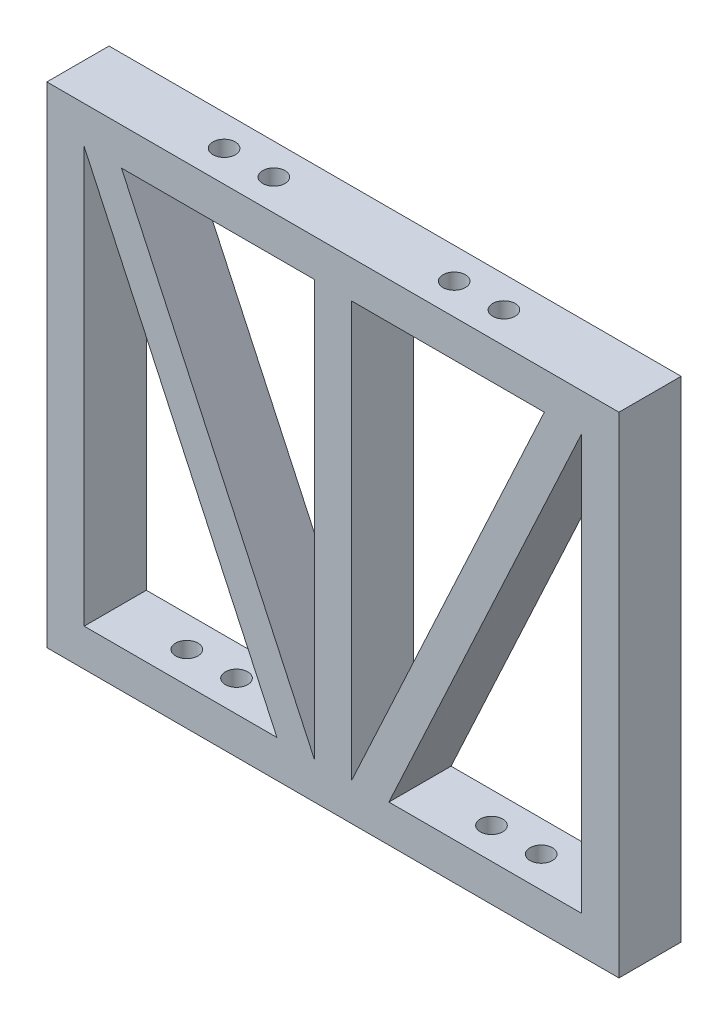
ISO-10303-21;
HEADER;
FILE_DESCRIPTION(('STEP AP214'),'2;1');
FILE_NAME('part.step','',(''),(''),'','','');
FILE_SCHEMA(('AUTOMOTIVE_DESIGN { 1 0 10303 214 1 1 1 1 }'));
ENDSEC;
DATA;
#1=APPLICATION_CONTEXT('core data for automotive mechanical design processes');
#2=APPLICATION_PROTOCOL_DEFINITION('international standard','automotive_design',2000,#1);
#3=PRODUCT_CONTEXT('',#1,'mechanical');
#4=PRODUCT('Part','Part','',(#3));
#5=PRODUCT_RELATED_PRODUCT_CATEGORY('part','',(#4));
#6=PRODUCT_DEFINITION_FORMATION('','',#4);
#7=PRODUCT_DEFINITION_CONTEXT('part definition',#1,'design');
#8=PRODUCT_DEFINITION('design','',#6,#7);
#9=PRODUCT_DEFINITION_SHAPE('','',#8);
#10=(LENGTH_UNIT() NAMED_UNIT(*) SI_UNIT(.MILLI.,.METRE.));
#11=(NAMED_UNIT(*) PLANE_ANGLE_UNIT() SI_UNIT($,.RADIAN.));
#12=(NAMED_UNIT(*) SI_UNIT($,.STERADIAN.) SOLID_ANGLE_UNIT());
#13=UNCERTAINTY_MEASURE_WITH_UNIT(LENGTH_MEASURE(1.E-05),#10,'distance_accuracy_value','');
#14=(GEOMETRIC_REPRESENTATION_CONTEXT(3) GLOBAL_UNCERTAINTY_ASSIGNED_CONTEXT((#13)) GLOBAL_UNIT_ASSIGNED_CONTEXT((#10,
#11,#12)) REPRESENTATION_CONTEXT('',''));
#15=CARTESIAN_POINT('',(0.,0.,0.));
#16=DIRECTION('',(0.,0.,1.));
#17=DIRECTION('',(1.,0.,0.));
#18=AXIS2_PLACEMENT_3D('',#15,#16,#17);
#19=CARTESIAN_POINT('',(0.,0.,6.35));
#20=DIRECTION('',(0.,0.,-1.));
#21=DIRECTION('',(-1.,0.,0.));
#22=AXIS2_PLACEMENT_3D('',#19,#20,#21);
#23=PLANE('',#22);
#24=DIRECTION('',(0.,1.,0.));
#25=VECTOR('',#24,1.);
#26=CARTESIAN_POINT('',(-1.905,3.81,6.35));
#27=LINE('',#26,#25);
#28=CARTESIAN_POINT('',(-1.905,3.81,6.35));
#29=VERTEX_POINT('',#28);
#30=CARTESIAN_POINT('',(-1.905,46.228,6.35));
#31=VERTEX_POINT('',#30);
#32=EDGE_CURVE('E178',#29,#31,#27,.T.);
#33=ORIENTED_EDGE('',*,*,#32,.F.);
#34=DIRECTION('',(0.42095171359802,-0.907083047366056,0.));
#35=VECTOR('',#34,1.);
#36=CARTESIAN_POINT('',(-21.59,46.228,6.35));
#37=LINE('',#36,#35);
#38=CARTESIAN_POINT('',(-21.59,46.228,6.35));
#39=VERTEX_POINT('',#38);
#40=EDGE_CURVE('E184',#39,#29,#37,.T.);
#41=ORIENTED_EDGE('',*,*,#40,.F.);
#42=DIRECTION('',(-1.,0.,0.));
#43=VECTOR('',#42,1.);
#44=CARTESIAN_POINT('',(-1.905,46.228,6.35));
#45=LINE('',#44,#43);
#46=EDGE_CURVE('E180',#31,#39,#45,.T.);
#47=ORIENTED_EDGE('',*,*,#46,.F.);
#48=EDGE_LOOP('',(#33,#41,#47));
#49=FACE_BOUND('',#48,.T.);
#50=DIRECTION('',(-0.42095171359802,0.907083047366056,0.));
#51=VECTOR('',#50,1.);
#52=CARTESIAN_POINT('',(-5.715,3.81,6.35));
#53=LINE('',#52,#51);
#54=CARTESIAN_POINT('',(-5.715,3.81,6.35));
#55=VERTEX_POINT('',#54);
#56=CARTESIAN_POINT('',(-25.4,46.228,6.35));
#57=VERTEX_POINT('',#56);
#58=EDGE_CURVE('E226',#55,#57,#53,.T.);
#59=ORIENTED_EDGE('',*,*,#58,.F.);
#60=DIRECTION('',(1.,0.,0.));
#61=VECTOR('',#60,1.);
#62=CARTESIAN_POINT('',(-25.4,3.81,6.35));
#63=LINE('',#62,#61);
#64=CARTESIAN_POINT('',(-25.4,3.81,6.35));
#65=VERTEX_POINT('',#64);
#66=EDGE_CURVE('E232',#65,#55,#63,.T.);
#67=ORIENTED_EDGE('',*,*,#66,.F.);
#68=DIRECTION('',(0.,-1.,0.));
#69=VECTOR('',#68,1.);
#70=CARTESIAN_POINT('',(-25.4,46.228,6.35));
#71=LINE('',#70,#69);
#72=EDGE_CURVE('E228',#57,#65,#71,.T.);
#73=ORIENTED_EDGE('',*,*,#72,.F.);
#74=EDGE_LOOP('',(#59,#67,#73));
#75=FACE_BOUND('',#74,.T.);
#76=DIRECTION('',(0.,-1.,0.));
#77=VECTOR('',#76,1.);
#78=CARTESIAN_POINT('',(-29.21,0.,6.35));
#79=LINE('',#78,#77);
#80=CARTESIAN_POINT('',(-29.21,50.038,6.35));
#81=VERTEX_POINT('',#80);
#82=CARTESIAN_POINT('',(-29.21,0.,6.35));
#83=VERTEX_POINT('',#82);
#84=EDGE_CURVE('E250',#81,#83,#79,.T.);
#85=ORIENTED_EDGE('',*,*,#84,.T.);
#86=DIRECTION('',(1.,0.,0.));
#87=VECTOR('',#86,1.);
#88=CARTESIAN_POINT('',(-29.21,0.,6.35));
#89=LINE('',#88,#87);
#90=CARTESIAN_POINT('',(29.21,0.,6.35));
#91=VERTEX_POINT('',#90);
#92=EDGE_CURVE('E253',#83,#91,#89,.T.);
#93=ORIENTED_EDGE('',*,*,#92,.T.);
#94=DIRECTION('',(0.,1.,0.));
#95=VECTOR('',#94,1.);
#96=CARTESIAN_POINT('',(29.21,0.,6.35));
#97=LINE('',#96,#95);
#98=CARTESIAN_POINT('',(29.21,50.038,6.35));
#99=VERTEX_POINT('',#98);
#100=EDGE_CURVE('E256',#91,#99,#97,.T.);
#101=ORIENTED_EDGE('',*,*,#100,.T.);
#102=DIRECTION('',(-1.,0.,0.));
#103=VECTOR('',#102,1.);
#104=CARTESIAN_POINT('',(-29.21,50.038,6.35));
#105=LINE('',#104,#103);
#106=EDGE_CURVE('E258',#99,#81,#105,.T.);
#107=ORIENTED_EDGE('',*,*,#106,.T.);
#108=EDGE_LOOP('',(#85,#93,#101,#107));
#109=FACE_BOUND('',#108,.T.);
#110=DIRECTION('',(-1.,0.,0.));
#111=VECTOR('',#110,1.);
#112=CARTESIAN_POINT('',(21.59,46.228,6.35));
#113=LINE('',#112,#111);
#114=CARTESIAN_POINT('',(21.59,46.228,6.35));
#115=VERTEX_POINT('',#114);
#116=CARTESIAN_POINT('',(1.905,46.228,6.35));
#117=VERTEX_POINT('',#116);
#118=EDGE_CURVE('E202',#115,#117,#113,.T.);
#119=ORIENTED_EDGE('',*,*,#118,.F.);
#120=DIRECTION('',(0.42095171359802,0.907083047366056,0.));
#121=VECTOR('',#120,1.);
#122=CARTESIAN_POINT('',(1.90500000000001,3.81,6.35));
#123=LINE('',#122,#121);
#124=CARTESIAN_POINT('',(1.90500000000001,3.81,6.35));
#125=VERTEX_POINT('',#124);
#126=EDGE_CURVE('E208',#125,#115,#123,.T.);
#127=ORIENTED_EDGE('',*,*,#126,.F.);
#128=DIRECTION('',(0.,-1.,0.));
#129=VECTOR('',#128,1.);
#130=CARTESIAN_POINT('',(1.905,46.228,6.35));
#131=LINE('',#130,#129);
#132=EDGE_CURVE('E204',#117,#125,#131,.T.);
#133=ORIENTED_EDGE('',*,*,#132,.F.);
#134=EDGE_LOOP('',(#119,#127,#133));
#135=FACE_BOUND('',#134,.T.);
#136=DIRECTION('',(1.,0.,0.));
#137=VECTOR('',#136,1.);
#138=CARTESIAN_POINT('',(25.4,3.81,6.35));
#139=LINE('',#138,#137);
#140=CARTESIAN_POINT('',(5.71500000000001,3.81,6.35));
#141=VERTEX_POINT('',#140);
#142=CARTESIAN_POINT('',(25.4,3.81,6.35));
#143=VERTEX_POINT('',#142);
#144=EDGE_CURVE('E149',#141,#143,#139,.T.);
#145=ORIENTED_EDGE('',*,*,#144,.F.);
#146=DIRECTION('',(-0.42095171359802,-0.907083047366056,0.));
#147=VECTOR('',#146,1.);
#148=CARTESIAN_POINT('',(5.71500000000001,3.81,6.35));
#149=LINE('',#148,#147);
#150=CARTESIAN_POINT('',(25.4,46.228,6.35));
#151=VERTEX_POINT('',#150);
#152=EDGE_CURVE('E166',#151,#141,#149,.T.);
#153=ORIENTED_EDGE('',*,*,#152,.F.);
#154=DIRECTION('',(0.,1.,0.));
#155=VECTOR('',#154,1.);
#156=CARTESIAN_POINT('',(25.4,46.228,6.35));
#157=LINE('',#156,#155);
#158=EDGE_CURVE('E157',#143,#151,#157,.T.);
#159=ORIENTED_EDGE('',*,*,#158,.F.);
#160=EDGE_LOOP('',(#145,#153,#159));
#161=FACE_BOUND('',#160,.T.);
#162=ADVANCED_FACE('F36',(#49,#75,#109,#135,#161),#23,.F.);
#163=CARTESIAN_POINT('',(0.,0.,0.));
#164=DIRECTION('',(0.,0.,-1.));
#165=DIRECTION('',(-1.,0.,0.));
#166=AXIS2_PLACEMENT_3D('',#163,#164,#165);
#167=PLANE('',#166);
#168=DIRECTION('',(0.,-1.,0.));
#169=VECTOR('',#168,1.);
#170=CARTESIAN_POINT('',(-29.21,0.,0.));
#171=LINE('',#170,#169);
#172=CARTESIAN_POINT('',(-29.21,50.038,0.));
#173=VERTEX_POINT('',#172);
#174=CARTESIAN_POINT('',(-29.21,0.,0.));
#175=VERTEX_POINT('',#174);
#176=EDGE_CURVE('E249',#173,#175,#171,.T.);
#177=ORIENTED_EDGE('',*,*,#176,.F.);
#178=DIRECTION('',(-1.,0.,0.));
#179=VECTOR('',#178,1.);
#180=CARTESIAN_POINT('',(-29.21,50.038,0.));
#181=LINE('',#180,#179);
#182=CARTESIAN_POINT('',(29.21,50.038,0.));
#183=VERTEX_POINT('',#182);
#184=EDGE_CURVE('E254',#183,#173,#181,.T.);
#185=ORIENTED_EDGE('',*,*,#184,.F.);
#186=DIRECTION('',(0.,1.,0.));
#187=VECTOR('',#186,1.);
#188=CARTESIAN_POINT('',(29.21,0.,0.));
#189=LINE('',#188,#187);
#190=CARTESIAN_POINT('',(29.21,0.,0.));
#191=VERTEX_POINT('',#190);
#192=EDGE_CURVE('E265',#191,#183,#189,.T.);
#193=ORIENTED_EDGE('',*,*,#192,.F.);
#194=DIRECTION('',(1.,0.,0.));
#195=VECTOR('',#194,1.);
#196=CARTESIAN_POINT('',(-29.21,0.,0.));
#197=LINE('',#196,#195);
#198=EDGE_CURVE('E263',#175,#191,#197,.T.);
#199=ORIENTED_EDGE('',*,*,#198,.F.);
#200=EDGE_LOOP('',(#177,#185,#193,#199));
#201=FACE_BOUND('',#200,.T.);
#202=DIRECTION('',(1.,0.,0.));
#203=VECTOR('',#202,1.);
#204=CARTESIAN_POINT('',(-25.4,3.81,0.));
#205=LINE('',#204,#203);
#206=CARTESIAN_POINT('',(-25.4,3.81,0.));
#207=VERTEX_POINT('',#206);
#208=CARTESIAN_POINT('',(-5.715,3.81,0.));
#209=VERTEX_POINT('',#208);
#210=EDGE_CURVE('E229',#207,#209,#205,.T.);
#211=ORIENTED_EDGE('',*,*,#210,.T.);
#212=DIRECTION('',(-0.42095171359802,0.907083047366056,0.));
#213=VECTOR('',#212,1.);
#214=CARTESIAN_POINT('',(-5.715,3.81,0.));
#215=LINE('',#214,#213);
#216=CARTESIAN_POINT('',(-25.4,46.228,0.));
#217=VERTEX_POINT('',#216);
#218=EDGE_CURVE('E225',#209,#217,#215,.T.);
#219=ORIENTED_EDGE('',*,*,#218,.T.);
#220=DIRECTION('',(0.,-1.,0.));
#221=VECTOR('',#220,1.);
#222=CARTESIAN_POINT('',(-25.4,46.228,0.));
#223=LINE('',#222,#221);
#224=EDGE_CURVE('E237',#217,#207,#223,.T.);
#225=ORIENTED_EDGE('',*,*,#224,.T.);
#226=EDGE_LOOP('',(#211,#219,#225));
#227=FACE_BOUND('',#226,.T.);
#228=DIRECTION('',(0.42095171359802,0.907083047366056,0.));
#229=VECTOR('',#228,1.);
#230=CARTESIAN_POINT('',(1.90500000000001,3.81,0.));
#231=LINE('',#230,#229);
#232=CARTESIAN_POINT('',(1.90500000000001,3.81,0.));
#233=VERTEX_POINT('',#232);
#234=CARTESIAN_POINT('',(21.59,46.228,0.));
#235=VERTEX_POINT('',#234);
#236=EDGE_CURVE('E205',#233,#235,#231,.T.);
#237=ORIENTED_EDGE('',*,*,#236,.T.);
#238=DIRECTION('',(-1.,0.,0.));
#239=VECTOR('',#238,1.);
#240=CARTESIAN_POINT('',(21.59,46.228,0.));
#241=LINE('',#240,#239);
#242=CARTESIAN_POINT('',(1.905,46.228,0.));
#243=VERTEX_POINT('',#242);
#244=EDGE_CURVE('E201',#235,#243,#241,.T.);
#245=ORIENTED_EDGE('',*,*,#244,.T.);
#246=DIRECTION('',(0.,-1.,0.));
#247=VECTOR('',#246,1.);
#248=CARTESIAN_POINT('',(1.905,46.228,0.));
#249=LINE('',#248,#247);
#250=EDGE_CURVE('E213',#243,#233,#249,.T.);
#251=ORIENTED_EDGE('',*,*,#250,.T.);
#252=EDGE_LOOP('',(#237,#245,#251));
#253=FACE_BOUND('',#252,.T.);
#254=DIRECTION('',(0.42095171359802,-0.907083047366056,0.));
#255=VECTOR('',#254,1.);
#256=CARTESIAN_POINT('',(-21.59,46.228,0.));
#257=LINE('',#256,#255);
#258=CARTESIAN_POINT('',(-21.59,46.228,0.));
#259=VERTEX_POINT('',#258);
#260=CARTESIAN_POINT('',(-1.905,3.81,0.));
#261=VERTEX_POINT('',#260);
#262=EDGE_CURVE('E181',#259,#261,#257,.T.);
#263=ORIENTED_EDGE('',*,*,#262,.T.);
#264=DIRECTION('',(0.,1.,0.));
#265=VECTOR('',#264,1.);
#266=CARTESIAN_POINT('',(-1.905,3.81,0.));
#267=LINE('',#266,#265);
#268=CARTESIAN_POINT('',(-1.905,46.228,0.));
#269=VERTEX_POINT('',#268);
#270=EDGE_CURVE('E164',#261,#269,#267,.T.);
#271=ORIENTED_EDGE('',*,*,#270,.T.);
#272=DIRECTION('',(-1.,0.,0.));
#273=VECTOR('',#272,1.);
#274=CARTESIAN_POINT('',(-1.905,46.228,0.));
#275=LINE('',#274,#273);
#276=EDGE_CURVE('E189',#269,#259,#275,.T.);
#277=ORIENTED_EDGE('',*,*,#276,.T.);
#278=EDGE_LOOP('',(#263,#271,#277));
#279=FACE_BOUND('',#278,.T.);
#280=DIRECTION('',(-0.42095171359802,-0.907083047366056,0.));
#281=VECTOR('',#280,1.);
#282=CARTESIAN_POINT('',(5.71500000000001,3.81,0.));
#283=LINE('',#282,#281);
#284=CARTESIAN_POINT('',(25.4,46.228,0.));
#285=VERTEX_POINT('',#284);
#286=CARTESIAN_POINT('',(5.71500000000001,3.81,0.));
#287=VERTEX_POINT('',#286);
#288=EDGE_CURVE('E158',#285,#287,#283,.T.);
#289=ORIENTED_EDGE('',*,*,#288,.T.);
#290=DIRECTION('',(1.,0.,0.));
#291=VECTOR('',#290,1.);
#292=CARTESIAN_POINT('',(25.4,3.81,0.));
#293=LINE('',#292,#291);
#294=CARTESIAN_POINT('',(25.4,3.81,0.));
#295=VERTEX_POINT('',#294);
#296=EDGE_CURVE('E59',#287,#295,#293,.T.);
#297=ORIENTED_EDGE('',*,*,#296,.T.);
#298=DIRECTION('',(0.,1.,0.));
#299=VECTOR('',#298,1.);
#300=CARTESIAN_POINT('',(25.4,46.228,0.));
#301=LINE('',#300,#299);
#302=EDGE_CURVE('E163',#295,#285,#301,.T.);
#303=ORIENTED_EDGE('',*,*,#302,.T.);
#304=EDGE_LOOP('',(#289,#297,#303));
#305=FACE_BOUND('',#304,.T.);
#306=ADVANCED_FACE('F283',(#201,#227,#253,#279,#305),#167,.T.);
#307=CARTESIAN_POINT('',(-29.21,0.,6.35));
#308=DIRECTION('',(1.,0.,0.));
#309=DIRECTION('',(0.,1.,0.));
#310=AXIS2_PLACEMENT_3D('',#307,#308,#309);
#311=PLANE('',#310);
#312=ORIENTED_EDGE('',*,*,#176,.T.);
#313=DIRECTION('',(0.,0.,-1.));
#314=VECTOR('',#313,1.);
#315=CARTESIAN_POINT('',(-29.21,0.,6.35));
#316=LINE('',#315,#314);
#317=EDGE_CURVE('E11',#83,#175,#316,.T.);
#318=ORIENTED_EDGE('',*,*,#317,.F.);
#319=ORIENTED_EDGE('',*,*,#84,.F.);
#320=DIRECTION('',(0.,0.,-1.));
#321=VECTOR('',#320,1.);
#322=CARTESIAN_POINT('',(-29.21,50.038,6.35));
#323=LINE('',#322,#321);
#324=EDGE_CURVE('E260',#81,#173,#323,.T.);
#325=ORIENTED_EDGE('',*,*,#324,.T.);
#326=EDGE_LOOP('',(#312,#318,#319,#325));
#327=FACE_BOUND('',#326,.T.);
#328=ADVANCED_FACE('F38',(#327),#311,.F.);
#329=CARTESIAN_POINT('',(-29.21,0.,6.35));
#330=DIRECTION('',(0.,1.,0.));
#331=DIRECTION('',(-1.,0.,0.));
#332=AXIS2_PLACEMENT_3D('',#329,#330,#331);
#333=PLANE('',#332);
#334=CARTESIAN_POINT('',(-18.0975,0.,3.175));
#335=DIRECTION('',(0.,1.,0.));
#336=DIRECTION('',(0.,0.,1.));
#337=AXIS2_PLACEMENT_3D('',#334,#335,#336);
#338=CIRCLE('',#337,1.143);
#339=CARTESIAN_POINT('',(-18.0975,0.,4.318));
#340=VERTEX_POINT('',#339);
#341=EDGE_CURVE('E348',#340,#340,#338,.T.);
#342=ORIENTED_EDGE('',*,*,#341,.T.);
#343=EDGE_LOOP('',(#342));
#344=FACE_BOUND('',#343,.T.);
#345=CARTESIAN_POINT('',(13.0175,0.,3.175));
#346=DIRECTION('',(0.,1.,0.));
#347=DIRECTION('',(0.,0.,1.));
#348=AXIS2_PLACEMENT_3D('',#345,#346,#347);
#349=CIRCLE('',#348,1.143);
#350=CARTESIAN_POINT('',(13.0175,0.,4.318));
#351=VERTEX_POINT('',#350);
#352=EDGE_CURVE('E355',#351,#351,#349,.T.);
#353=ORIENTED_EDGE('',*,*,#352,.T.);
#354=EDGE_LOOP('',(#353));
#355=FACE_BOUND('',#354,.T.);
#356=CARTESIAN_POINT('',(18.0975,0.,3.175));
#357=DIRECTION('',(0.,1.,0.));
#358=DIRECTION('',(0.,0.,1.));
#359=AXIS2_PLACEMENT_3D('',#356,#357,#358);
#360=CIRCLE('',#359,1.143);
#361=CARTESIAN_POINT('',(18.0975,0.,4.318));
#362=VERTEX_POINT('',#361);
#363=EDGE_CURVE('E354',#362,#362,#360,.T.);
#364=ORIENTED_EDGE('',*,*,#363,.T.);
#365=EDGE_LOOP('',(#364));
#366=FACE_BOUND('',#365,.T.);
#367=CARTESIAN_POINT('',(-13.0175,0.,3.175));
#368=DIRECTION('',(0.,1.,0.));
#369=DIRECTION('',(0.,0.,1.));
#370=AXIS2_PLACEMENT_3D('',#367,#368,#369);
#371=CIRCLE('',#370,1.143);
#372=CARTESIAN_POINT('',(-13.0175,0.,4.318));
#373=VERTEX_POINT('',#372);
#374=EDGE_CURVE('E361',#373,#373,#371,.T.);
#375=ORIENTED_EDGE('',*,*,#374,.T.);
#376=EDGE_LOOP('',(#375));
#377=FACE_BOUND('',#376,.T.);
#378=ORIENTED_EDGE('',*,*,#198,.T.);
#379=DIRECTION('',(0.,0.,-1.));
#380=VECTOR('',#379,1.);
#381=CARTESIAN_POINT('',(29.21,0.,6.35));
#382=LINE('',#381,#380);
#383=EDGE_CURVE('E44',#91,#191,#382,.T.);
#384=ORIENTED_EDGE('',*,*,#383,.F.);
#385=ORIENTED_EDGE('',*,*,#92,.F.);
#386=ORIENTED_EDGE('',*,*,#317,.T.);
#387=EDGE_LOOP('',(#378,#384,#385,#386));
#388=FACE_BOUND('',#387,.T.);
#389=ADVANCED_FACE('F294',(#344,#355,#366,#377,#388),#333,.F.);
#390=CARTESIAN_POINT('',(29.21,0.,6.35));
#391=DIRECTION('',(-1.,0.,0.));
#392=DIRECTION('',(0.,-1.,0.));
#393=AXIS2_PLACEMENT_3D('',#390,#391,#392);
#394=PLANE('',#393);
#395=ORIENTED_EDGE('',*,*,#192,.T.);
#396=DIRECTION('',(0.,0.,-1.));
#397=VECTOR('',#396,1.);
#398=CARTESIAN_POINT('',(29.21,50.038,6.35));
#399=LINE('',#398,#397);
#400=EDGE_CURVE('E270',#99,#183,#399,.T.);
#401=ORIENTED_EDGE('',*,*,#400,.F.);
#402=ORIENTED_EDGE('',*,*,#100,.F.);
#403=ORIENTED_EDGE('',*,*,#383,.T.);
#404=EDGE_LOOP('',(#395,#401,#402,#403));
#405=FACE_BOUND('',#404,.T.);
#406=ADVANCED_FACE('F277',(#405),#394,.F.);
#407=CARTESIAN_POINT('',(-29.21,50.038,6.35));
#408=DIRECTION('',(0.,-1.,0.));
#409=DIRECTION('',(0.,0.,-1.));
#410=AXIS2_PLACEMENT_3D('',#407,#408,#409);
#411=PLANE('',#410);
#412=CARTESIAN_POINT('',(-14.2875,50.038,3.175));
#413=DIRECTION('',(0.,1.,0.));
#414=DIRECTION('',(0.,0.,1.));
#415=AXIS2_PLACEMENT_3D('',#412,#413,#414);
#416=CIRCLE('',#415,1.143);
#417=CARTESIAN_POINT('',(-14.2875,50.038,4.318));
#418=VERTEX_POINT('',#417);
#419=EDGE_CURVE('E327',#418,#418,#416,.T.);
#420=ORIENTED_EDGE('',*,*,#419,.F.);
#421=EDGE_LOOP('',(#420));
#422=FACE_BOUND('',#421,.T.);
#423=CARTESIAN_POINT('',(-9.2075,50.038,3.175));
#424=DIRECTION('',(0.,1.,0.));
#425=DIRECTION('',(0.,0.,1.));
#426=AXIS2_PLACEMENT_3D('',#423,#424,#425);
#427=CIRCLE('',#426,1.143);
#428=CARTESIAN_POINT('',(-9.2075,50.038,4.318));
#429=VERTEX_POINT('',#428);
#430=EDGE_CURVE('E331',#429,#429,#427,.T.);
#431=ORIENTED_EDGE('',*,*,#430,.F.);
#432=EDGE_LOOP('',(#431));
#433=FACE_BOUND('',#432,.T.);
#434=CARTESIAN_POINT('',(9.2075,50.038,3.175));
#435=DIRECTION('',(0.,1.,0.));
#436=DIRECTION('',(0.,0.,1.));
#437=AXIS2_PLACEMENT_3D('',#434,#435,#436);
#438=CIRCLE('',#437,1.143);
#439=CARTESIAN_POINT('',(9.2075,50.038,4.318));
#440=VERTEX_POINT('',#439);
#441=EDGE_CURVE('E335',#440,#440,#438,.T.);
#442=ORIENTED_EDGE('',*,*,#441,.F.);
#443=EDGE_LOOP('',(#442));
#444=FACE_BOUND('',#443,.T.);
#445=CARTESIAN_POINT('',(14.2875,50.038,3.175));
#446=DIRECTION('',(0.,1.,0.));
#447=DIRECTION('',(0.,0.,1.));
#448=AXIS2_PLACEMENT_3D('',#445,#446,#447);
#449=CIRCLE('',#448,1.143);
#450=CARTESIAN_POINT('',(14.2875,50.038,4.318));
#451=VERTEX_POINT('',#450);
#452=EDGE_CURVE('E338',#451,#451,#449,.T.);
#453=ORIENTED_EDGE('',*,*,#452,.F.);
#454=EDGE_LOOP('',(#453));
#455=FACE_BOUND('',#454,.T.);
#456=ORIENTED_EDGE('',*,*,#184,.T.);
#457=ORIENTED_EDGE('',*,*,#324,.F.);
#458=ORIENTED_EDGE('',*,*,#106,.F.);
#459=ORIENTED_EDGE('',*,*,#400,.T.);
#460=EDGE_LOOP('',(#456,#457,#458,#459));
#461=FACE_BOUND('',#460,.T.);
#462=ADVANCED_FACE('F287',(#422,#433,#444,#455,#461),#411,.F.);
#463=CARTESIAN_POINT('',(-5.715,3.81,6.35));
#464=DIRECTION('',(-0.907083047366056,-0.42095171359802,0.));
#465=DIRECTION('',(0.42095171359802,-0.907083047366056,0.));
#466=AXIS2_PLACEMENT_3D('',#463,#464,#465);
#467=PLANE('',#466);
#468=ORIENTED_EDGE('',*,*,#218,.F.);
#469=DIRECTION('',(0.,0.,-1.));
#470=VECTOR('',#469,1.);
#471=CARTESIAN_POINT('',(-5.715,3.81,6.35));
#472=LINE('',#471,#470);
#473=EDGE_CURVE('E234',#55,#209,#472,.T.);
#474=ORIENTED_EDGE('',*,*,#473,.F.);
#475=ORIENTED_EDGE('',*,*,#58,.T.);
#476=DIRECTION('',(0.,0.,-1.));
#477=VECTOR('',#476,1.);
#478=CARTESIAN_POINT('',(-25.4,46.228,6.35));
#479=LINE('',#478,#477);
#480=EDGE_CURVE('E246',#57,#217,#479,.T.);
#481=ORIENTED_EDGE('',*,*,#480,.T.);
#482=EDGE_LOOP('',(#468,#474,#475,#481));
#483=FACE_BOUND('',#482,.T.);
#484=ADVANCED_FACE('F314',(#483),#467,.T.);
#485=CARTESIAN_POINT('',(-25.4,46.228,6.35));
#486=DIRECTION('',(1.,0.,0.));
#487=DIRECTION('',(0.,1.,0.));
#488=AXIS2_PLACEMENT_3D('',#485,#486,#487);
#489=PLANE('',#488);
#490=ORIENTED_EDGE('',*,*,#224,.F.);
#491=ORIENTED_EDGE('',*,*,#480,.F.);
#492=ORIENTED_EDGE('',*,*,#72,.T.);
#493=DIRECTION('',(0.,0.,-1.));
#494=VECTOR('',#493,1.);
#495=CARTESIAN_POINT('',(-25.4,3.81,6.35));
#496=LINE('',#495,#494);
#497=EDGE_CURVE('E244',#65,#207,#496,.T.);
#498=ORIENTED_EDGE('',*,*,#497,.T.);
#499=EDGE_LOOP('',(#490,#491,#492,#498));
#500=FACE_BOUND('',#499,.T.);
#501=ADVANCED_FACE('F322',(#500),#489,.T.);
#502=CARTESIAN_POINT('',(-25.4,3.81,6.35));
#503=DIRECTION('',(0.,1.,0.));
#504=DIRECTION('',(-1.,0.,0.));
#505=AXIS2_PLACEMENT_3D('',#502,#503,#504);
#506=PLANE('',#505);
#507=CARTESIAN_POINT('',(-18.0975,3.81,3.175));
#508=DIRECTION('',(0.,1.,0.));
#509=DIRECTION('',(0.,0.,1.));
#510=AXIS2_PLACEMENT_3D('',#507,#508,#509);
#511=CIRCLE('',#510,1.143);
#512=CARTESIAN_POINT('',(-18.0975,3.81,4.318));
#513=VERTEX_POINT('',#512);
#514=EDGE_CURVE('E172',#513,#513,#511,.T.);
#515=ORIENTED_EDGE('',*,*,#514,.F.);
#516=EDGE_LOOP('',(#515));
#517=FACE_BOUND('',#516,.T.);
#518=CARTESIAN_POINT('',(-13.0175,3.81,3.175));
#519=DIRECTION('',(0.,1.,0.));
#520=DIRECTION('',(0.,0.,1.));
#521=AXIS2_PLACEMENT_3D('',#518,#519,#520);
#522=CIRCLE('',#521,1.143);
#523=CARTESIAN_POINT('',(-13.0175,3.81,4.318));
#524=VERTEX_POINT('',#523);
#525=EDGE_CURVE('E350',#524,#524,#522,.T.);
#526=ORIENTED_EDGE('',*,*,#525,.F.);
#527=EDGE_LOOP('',(#526));
#528=FACE_BOUND('',#527,.T.);
#529=ORIENTED_EDGE('',*,*,#210,.F.);
#530=ORIENTED_EDGE('',*,*,#497,.F.);
#531=ORIENTED_EDGE('',*,*,#66,.T.);
#532=ORIENTED_EDGE('',*,*,#473,.T.);
#533=EDGE_LOOP('',(#529,#530,#531,#532));
#534=FACE_BOUND('',#533,.T.);
#535=ADVANCED_FACE('F415',(#517,#528,#534),#506,.T.);
#536=CARTESIAN_POINT('',(21.59,46.228,6.35));
#537=DIRECTION('',(0.,-1.,0.));
#538=DIRECTION('',(0.,0.,-1.));
#539=AXIS2_PLACEMENT_3D('',#536,#537,#538);
#540=PLANE('',#539);
#541=CARTESIAN_POINT('',(9.2075,46.228,3.175));
#542=DIRECTION('',(0.,1.,0.));
#543=DIRECTION('',(0.,0.,1.));
#544=AXIS2_PLACEMENT_3D('',#541,#542,#543);
#545=CIRCLE('',#544,1.143);
#546=CARTESIAN_POINT('',(9.2075,46.228,4.318));
#547=VERTEX_POINT('',#546);
#548=EDGE_CURVE('E609',#547,#547,#545,.T.);
#549=ORIENTED_EDGE('',*,*,#548,.T.);
#550=EDGE_LOOP('',(#549));
#551=FACE_BOUND('',#550,.T.);
#552=CARTESIAN_POINT('',(14.2875,46.228,3.175));
#553=DIRECTION('',(0.,1.,0.));
#554=DIRECTION('',(0.,0.,1.));
#555=AXIS2_PLACEMENT_3D('',#552,#553,#554);
#556=CIRCLE('',#555,1.143);
#557=CARTESIAN_POINT('',(14.2875,46.228,4.318));
#558=VERTEX_POINT('',#557);
#559=EDGE_CURVE('E340',#558,#558,#556,.T.);
#560=ORIENTED_EDGE('',*,*,#559,.T.);
#561=EDGE_LOOP('',(#560));
#562=FACE_BOUND('',#561,.T.);
#563=ORIENTED_EDGE('',*,*,#244,.F.);
#564=DIRECTION('',(0.,0.,-1.));
#565=VECTOR('',#564,1.);
#566=CARTESIAN_POINT('',(21.59,46.228,6.35));
#567=LINE('',#566,#565);
#568=EDGE_CURVE('E210',#115,#235,#567,.T.);
#569=ORIENTED_EDGE('',*,*,#568,.F.);
#570=ORIENTED_EDGE('',*,*,#118,.T.);
#571=DIRECTION('',(0.,0.,-1.));
#572=VECTOR('',#571,1.);
#573=CARTESIAN_POINT('',(1.905,46.228,6.35));
#574=LINE('',#573,#572);
#575=EDGE_CURVE('E222',#117,#243,#574,.T.);
#576=ORIENTED_EDGE('',*,*,#575,.T.);
#577=EDGE_LOOP('',(#563,#569,#570,#576));
#578=FACE_BOUND('',#577,.T.);
#579=ADVANCED_FACE('F411',(#551,#562,#578),#540,.T.);
#580=CARTESIAN_POINT('',(1.905,46.228,6.35));
#581=DIRECTION('',(1.,0.,0.));
#582=DIRECTION('',(0.,1.,0.));
#583=AXIS2_PLACEMENT_3D('',#580,#581,#582);
#584=PLANE('',#583);
#585=ORIENTED_EDGE('',*,*,#250,.F.);
#586=ORIENTED_EDGE('',*,*,#575,.F.);
#587=ORIENTED_EDGE('',*,*,#132,.T.);
#588=DIRECTION('',(0.,0.,-1.));
#589=VECTOR('',#588,1.);
#590=CARTESIAN_POINT('',(1.90500000000001,3.81,6.35));
#591=LINE('',#590,#589);
#592=EDGE_CURVE('E220',#125,#233,#591,.T.);
#593=ORIENTED_EDGE('',*,*,#592,.T.);
#594=EDGE_LOOP('',(#585,#586,#587,#593));
#595=FACE_BOUND('',#594,.T.);
#596=ADVANCED_FACE('F407',(#595),#584,.T.);
#597=CARTESIAN_POINT('',(1.90500000000001,3.81,6.35));
#598=DIRECTION('',(-0.907083047366056,0.42095171359802,0.));
#599=DIRECTION('',(-0.42095171359802,-0.907083047366056,0.));
#600=AXIS2_PLACEMENT_3D('',#597,#598,#599);
#601=PLANE('',#600);
#602=ORIENTED_EDGE('',*,*,#236,.F.);
#603=ORIENTED_EDGE('',*,*,#592,.F.);
#604=ORIENTED_EDGE('',*,*,#126,.T.);
#605=ORIENTED_EDGE('',*,*,#568,.T.);
#606=EDGE_LOOP('',(#602,#603,#604,#605));
#607=FACE_BOUND('',#606,.T.);
#608=ADVANCED_FACE('F403',(#607),#601,.T.);
#609=CARTESIAN_POINT('',(-1.905,3.81,6.35));
#610=DIRECTION('',(-1.,0.,0.));
#611=DIRECTION('',(0.,0.,1.));
#612=AXIS2_PLACEMENT_3D('',#609,#610,#611);
#613=PLANE('',#612);
#614=ORIENTED_EDGE('',*,*,#270,.F.);
#615=DIRECTION('',(0.,0.,-1.));
#616=VECTOR('',#615,1.);
#617=CARTESIAN_POINT('',(-1.905,3.81,6.35));
#618=LINE('',#617,#616);
#619=EDGE_CURVE('E186',#29,#261,#618,.T.);
#620=ORIENTED_EDGE('',*,*,#619,.F.);
#621=ORIENTED_EDGE('',*,*,#32,.T.);
#622=DIRECTION('',(0.,0.,-1.));
#623=VECTOR('',#622,1.);
#624=CARTESIAN_POINT('',(-1.905,46.228,6.35));
#625=LINE('',#624,#623);
#626=EDGE_CURVE('E198',#31,#269,#625,.T.);
#627=ORIENTED_EDGE('',*,*,#626,.T.);
#628=EDGE_LOOP('',(#614,#620,#621,#627));
#629=FACE_BOUND('',#628,.T.);
#630=ADVANCED_FACE('F399',(#629),#613,.T.);
#631=CARTESIAN_POINT('',(-1.905,46.228,6.35));
#632=DIRECTION('',(0.,-1.,0.));
#633=DIRECTION('',(1.,0.,0.));
#634=AXIS2_PLACEMENT_3D('',#631,#632,#633);
#635=PLANE('',#634);
#636=CARTESIAN_POINT('',(-14.2875,46.228,3.175));
#637=DIRECTION('',(0.,1.,0.));
#638=DIRECTION('',(0.,0.,1.));
#639=AXIS2_PLACEMENT_3D('',#636,#637,#638);
#640=CIRCLE('',#639,1.143);
#641=CARTESIAN_POINT('',(-14.2875,46.228,4.318));
#642=VERTEX_POINT('',#641);
#643=EDGE_CURVE('E358',#642,#642,#640,.T.);
#644=ORIENTED_EDGE('',*,*,#643,.T.);
#645=EDGE_LOOP('',(#644));
#646=FACE_BOUND('',#645,.T.);
#647=CARTESIAN_POINT('',(-9.2075,46.228,3.175));
#648=DIRECTION('',(0.,1.,0.));
#649=DIRECTION('',(0.,0.,1.));
#650=AXIS2_PLACEMENT_3D('',#647,#648,#649);
#651=CIRCLE('',#650,1.143);
#652=CARTESIAN_POINT('',(-9.2075,46.228,4.318));
#653=VERTEX_POINT('',#652);
#654=EDGE_CURVE('E613',#653,#653,#651,.T.);
#655=ORIENTED_EDGE('',*,*,#654,.T.);
#656=EDGE_LOOP('',(#655));
#657=FACE_BOUND('',#656,.T.);
#658=ORIENTED_EDGE('',*,*,#276,.F.);
#659=ORIENTED_EDGE('',*,*,#626,.F.);
#660=ORIENTED_EDGE('',*,*,#46,.T.);
#661=DIRECTION('',(0.,0.,-1.));
#662=VECTOR('',#661,1.);
#663=CARTESIAN_POINT('',(-21.59,46.228,6.35));
#664=LINE('',#663,#662);
#665=EDGE_CURVE('E196',#39,#259,#664,.T.);
#666=ORIENTED_EDGE('',*,*,#665,.T.);
#667=EDGE_LOOP('',(#658,#659,#660,#666));
#668=FACE_BOUND('',#667,.T.);
#669=ADVANCED_FACE('F395',(#646,#657,#668),#635,.T.);
#670=CARTESIAN_POINT('',(-21.59,46.228,6.35));
#671=DIRECTION('',(0.907083047366056,0.42095171359802,0.));
#672=DIRECTION('',(-0.42095171359802,0.907083047366056,0.));
#673=AXIS2_PLACEMENT_3D('',#670,#671,#672);
#674=PLANE('',#673);
#675=ORIENTED_EDGE('',*,*,#262,.F.);
#676=ORIENTED_EDGE('',*,*,#665,.F.);
#677=ORIENTED_EDGE('',*,*,#40,.T.);
#678=ORIENTED_EDGE('',*,*,#619,.T.);
#679=EDGE_LOOP('',(#675,#676,#677,#678));
#680=FACE_BOUND('',#679,.T.);
#681=ADVANCED_FACE('F391',(#680),#674,.T.);
#682=CARTESIAN_POINT('',(25.4,3.81,6.35));
#683=DIRECTION('',(0.,1.,0.));
#684=DIRECTION('',(-1.,0.,0.));
#685=AXIS2_PLACEMENT_3D('',#682,#683,#684);
#686=PLANE('',#685);
#687=CARTESIAN_POINT('',(13.0175,3.81,3.175));
#688=DIRECTION('',(0.,1.,0.));
#689=DIRECTION('',(0.,0.,1.));
#690=AXIS2_PLACEMENT_3D('',#687,#688,#689);
#691=CIRCLE('',#690,1.143);
#692=CARTESIAN_POINT('',(13.0175,3.81,4.318));
#693=VERTEX_POINT('',#692);
#694=EDGE_CURVE('E351',#693,#693,#691,.T.);
#695=ORIENTED_EDGE('',*,*,#694,.F.);
#696=EDGE_LOOP('',(#695));
#697=FACE_BOUND('',#696,.T.);
#698=CARTESIAN_POINT('',(18.0975,3.81,3.175));
#699=DIRECTION('',(0.,1.,0.));
#700=DIRECTION('',(0.,0.,1.));
#701=AXIS2_PLACEMENT_3D('',#698,#699,#700);
#702=CIRCLE('',#701,1.143);
#703=CARTESIAN_POINT('',(18.0975,3.81,4.318));
#704=VERTEX_POINT('',#703);
#705=EDGE_CURVE('E364',#704,#704,#702,.T.);
#706=ORIENTED_EDGE('',*,*,#705,.F.);
#707=EDGE_LOOP('',(#706));
#708=FACE_BOUND('',#707,.T.);
#709=ORIENTED_EDGE('',*,*,#296,.F.);
#710=DIRECTION('',(0.,0.,-1.));
#711=VECTOR('',#710,1.);
#712=CARTESIAN_POINT('',(5.71500000000001,3.81,6.35));
#713=LINE('',#712,#711);
#714=EDGE_CURVE('E153',#141,#287,#713,.T.);
#715=ORIENTED_EDGE('',*,*,#714,.F.);
#716=ORIENTED_EDGE('',*,*,#144,.T.);
#717=DIRECTION('',(0.,0.,-1.));
#718=VECTOR('',#717,1.);
#719=CARTESIAN_POINT('',(25.4,3.81,6.35));
#720=LINE('',#719,#718);
#721=EDGE_CURVE('E152',#143,#295,#720,.T.);
#722=ORIENTED_EDGE('',*,*,#721,.T.);
#723=EDGE_LOOP('',(#709,#715,#716,#722));
#724=FACE_BOUND('',#723,.T.);
#725=ADVANCED_FACE('F151',(#697,#708,#724),#686,.T.);
#726=CARTESIAN_POINT('',(25.4,46.228,6.35));
#727=DIRECTION('',(-1.,0.,0.));
#728=DIRECTION('',(0.,-1.,0.));
#729=AXIS2_PLACEMENT_3D('',#726,#727,#728);
#730=PLANE('',#729);
#731=ORIENTED_EDGE('',*,*,#302,.F.);
#732=ORIENTED_EDGE('',*,*,#721,.F.);
#733=ORIENTED_EDGE('',*,*,#158,.T.);
#734=DIRECTION('',(0.,0.,-1.));
#735=VECTOR('',#734,1.);
#736=CARTESIAN_POINT('',(25.4,46.228,6.35));
#737=LINE('',#736,#735);
#738=EDGE_CURVE('E51',#151,#285,#737,.T.);
#739=ORIENTED_EDGE('',*,*,#738,.T.);
#740=EDGE_LOOP('',(#731,#732,#733,#739));
#741=FACE_BOUND('',#740,.T.);
#742=ADVANCED_FACE('F161',(#741),#730,.T.);
#743=CARTESIAN_POINT('',(5.71500000000001,3.81,6.35));
#744=DIRECTION('',(0.907083047366056,-0.42095171359802,0.));
#745=DIRECTION('',(0.42095171359802,0.907083047366056,0.));
#746=AXIS2_PLACEMENT_3D('',#743,#744,#745);
#747=PLANE('',#746);
#748=ORIENTED_EDGE('',*,*,#288,.F.);
#749=ORIENTED_EDGE('',*,*,#738,.F.);
#750=ORIENTED_EDGE('',*,*,#152,.T.);
#751=ORIENTED_EDGE('',*,*,#714,.T.);
#752=EDGE_LOOP('',(#748,#749,#750,#751));
#753=FACE_BOUND('',#752,.T.);
#754=ADVANCED_FACE('F374',(#753),#747,.T.);
#755=CARTESIAN_POINT('',(18.0975,3.81,3.175));
#756=DIRECTION('',(0.,-1.,0.));
#757=DIRECTION('',(0.,0.,-1.));
#758=AXIS2_PLACEMENT_3D('',#755,#756,#757);
#759=CYLINDRICAL_SURFACE('',#758,1.143);
#760=ORIENTED_EDGE('',*,*,#705,.T.);
#761=EDGE_LOOP('',(#760));
#762=FACE_BOUND('',#761,.T.);
#763=ORIENTED_EDGE('',*,*,#363,.F.);
#764=EDGE_LOOP('',(#763));
#765=FACE_BOUND('',#764,.T.);
#766=ADVANCED_FACE('F371',(#762,#765),#759,.F.);
#767=CARTESIAN_POINT('',(13.0175,3.81,3.175));
#768=DIRECTION('',(0.,-1.,0.));
#769=DIRECTION('',(0.,0.,-1.));
#770=AXIS2_PLACEMENT_3D('',#767,#768,#769);
#771=CYLINDRICAL_SURFACE('',#770,1.143);
#772=ORIENTED_EDGE('',*,*,#694,.T.);
#773=EDGE_LOOP('',(#772));
#774=FACE_BOUND('',#773,.T.);
#775=ORIENTED_EDGE('',*,*,#352,.F.);
#776=EDGE_LOOP('',(#775));
#777=FACE_BOUND('',#776,.T.);
#778=ADVANCED_FACE('F373',(#774,#777),#771,.F.);
#779=CARTESIAN_POINT('',(-13.0175,3.81,3.175));
#780=DIRECTION('',(0.,-1.,0.));
#781=DIRECTION('',(0.,0.,-1.));
#782=AXIS2_PLACEMENT_3D('',#779,#780,#781);
#783=CYLINDRICAL_SURFACE('',#782,1.143);
#784=ORIENTED_EDGE('',*,*,#525,.T.);
#785=EDGE_LOOP('',(#784));
#786=FACE_BOUND('',#785,.T.);
#787=ORIENTED_EDGE('',*,*,#374,.F.);
#788=EDGE_LOOP('',(#787));
#789=FACE_BOUND('',#788,.T.);
#790=ADVANCED_FACE('F381',(#786,#789),#783,.F.);
#791=CARTESIAN_POINT('',(-18.0975,3.81,3.175));
#792=DIRECTION('',(0.,-1.,0.));
#793=DIRECTION('',(0.,0.,-1.));
#794=AXIS2_PLACEMENT_3D('',#791,#792,#793);
#795=CYLINDRICAL_SURFACE('',#794,1.143);
#796=ORIENTED_EDGE('',*,*,#514,.T.);
#797=EDGE_LOOP('',(#796));
#798=FACE_BOUND('',#797,.T.);
#799=ORIENTED_EDGE('',*,*,#341,.F.);
#800=EDGE_LOOP('',(#799));
#801=FACE_BOUND('',#800,.T.);
#802=ADVANCED_FACE('F537',(#798,#801),#795,.F.);
#803=CARTESIAN_POINT('',(-9.2075,46.228,3.175));
#804=DIRECTION('',(0.,1.,0.));
#805=DIRECTION('',(0.,0.,1.));
#806=AXIS2_PLACEMENT_3D('',#803,#804,#805);
#807=CYLINDRICAL_SURFACE('',#806,1.143);
#808=ORIENTED_EDGE('',*,*,#654,.F.);
#809=EDGE_LOOP('',(#808));
#810=FACE_BOUND('',#809,.T.);
#811=ORIENTED_EDGE('',*,*,#430,.T.);
#812=EDGE_LOOP('',(#811));
#813=FACE_BOUND('',#812,.T.);
#814=ADVANCED_FACE('F542',(#810,#813),#807,.F.);
#815=CARTESIAN_POINT('',(-14.2875,46.228,3.175));
#816=DIRECTION('',(0.,1.,0.));
#817=DIRECTION('',(0.,0.,1.));
#818=AXIS2_PLACEMENT_3D('',#815,#816,#817);
#819=CYLINDRICAL_SURFACE('',#818,1.143);
#820=ORIENTED_EDGE('',*,*,#643,.F.);
#821=EDGE_LOOP('',(#820));
#822=FACE_BOUND('',#821,.T.);
#823=ORIENTED_EDGE('',*,*,#419,.T.);
#824=EDGE_LOOP('',(#823));
#825=FACE_BOUND('',#824,.T.);
#826=ADVANCED_FACE('F572',(#822,#825),#819,.F.);
#827=CARTESIAN_POINT('',(14.2875,46.228,3.175));
#828=DIRECTION('',(0.,1.,0.));
#829=DIRECTION('',(0.,0.,1.));
#830=AXIS2_PLACEMENT_3D('',#827,#828,#829);
#831=CYLINDRICAL_SURFACE('',#830,1.143);
#832=ORIENTED_EDGE('',*,*,#559,.F.);
#833=EDGE_LOOP('',(#832));
#834=FACE_BOUND('',#833,.T.);
#835=ORIENTED_EDGE('',*,*,#452,.T.);
#836=EDGE_LOOP('',(#835));
#837=FACE_BOUND('',#836,.T.);
#838=ADVANCED_FACE('F579',(#834,#837),#831,.F.);
#839=CARTESIAN_POINT('',(9.2075,46.228,3.175));
#840=DIRECTION('',(0.,1.,0.));
#841=DIRECTION('',(0.,0.,1.));
#842=AXIS2_PLACEMENT_3D('',#839,#840,#841);
#843=CYLINDRICAL_SURFACE('',#842,1.143);
#844=ORIENTED_EDGE('',*,*,#548,.F.);
#845=EDGE_LOOP('',(#844));
#846=FACE_BOUND('',#845,.T.);
#847=ORIENTED_EDGE('',*,*,#441,.T.);
#848=EDGE_LOOP('',(#847));
#849=FACE_BOUND('',#848,.T.);
#850=ADVANCED_FACE('F587',(#846,#849),#843,.F.);
#851=CLOSED_SHELL('',(#162,#306,#328,#389,#406,#462,#484,#501,#535,#579,#596,#608,#630,#669,
#681,#725,#742,#754,#766,#778,#790,#802,#814,#826,#838,#850));
#852=MANIFOLD_SOLID_BREP('B2',#851);
#853=ADVANCED_BREP_SHAPE_REPRESENTATION('',(#18,#852),#14);
#854=SHAPE_DEFINITION_REPRESENTATION(#9,#853);
ENDSEC;
END-ISO-10303-21;
